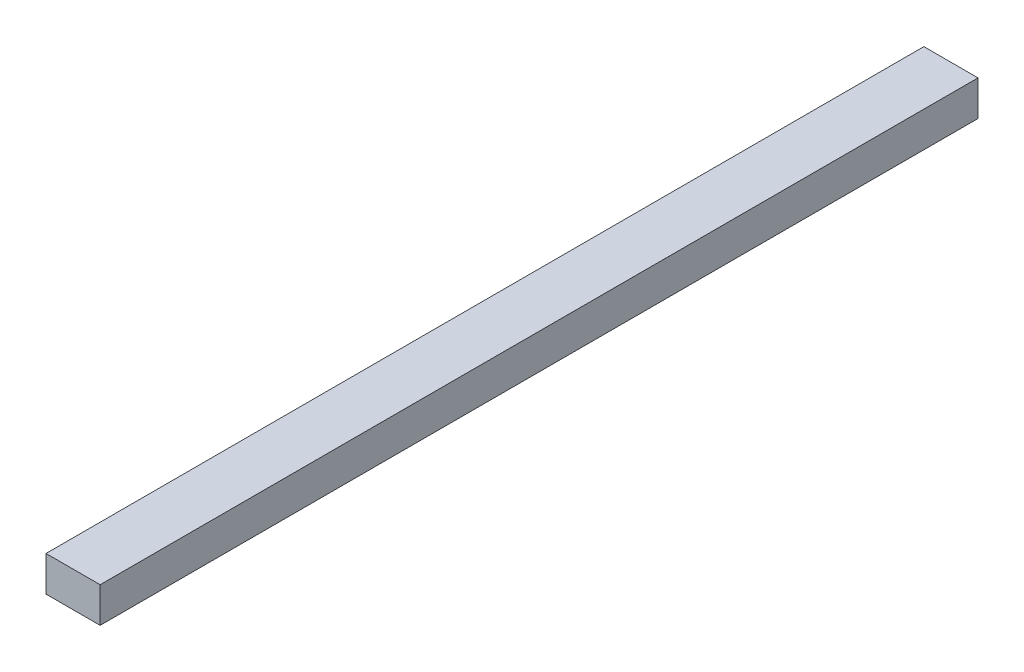
ISO-10303-21;
HEADER;
FILE_DESCRIPTION(('STEP AP214'),'2;1');
FILE_NAME('part.step','',(''),(''),'','','');
FILE_SCHEMA(('AUTOMOTIVE_DESIGN { 1 0 10303 214 1 1 1 1 }'));
ENDSEC;
DATA;
#1=APPLICATION_CONTEXT('core data for automotive mechanical design processes');
#2=APPLICATION_PROTOCOL_DEFINITION('international standard','automotive_design',2000,#1);
#3=PRODUCT_CONTEXT('',#1,'mechanical');
#4=PRODUCT('Part','Part','',(#3));
#5=PRODUCT_RELATED_PRODUCT_CATEGORY('part','',(#4));
#6=PRODUCT_DEFINITION_FORMATION('','',#4);
#7=PRODUCT_DEFINITION_CONTEXT('part definition',#1,'design');
#8=PRODUCT_DEFINITION('design','',#6,#7);
#9=PRODUCT_DEFINITION_SHAPE('','',#8);
#10=(LENGTH_UNIT() NAMED_UNIT(*) SI_UNIT(.MILLI.,.METRE.));
#11=(NAMED_UNIT(*) PLANE_ANGLE_UNIT() SI_UNIT($,.RADIAN.));
#12=(NAMED_UNIT(*) SI_UNIT($,.STERADIAN.) SOLID_ANGLE_UNIT());
#13=UNCERTAINTY_MEASURE_WITH_UNIT(LENGTH_MEASURE(1.E-05),#10,'distance_accuracy_value','');
#14=(GEOMETRIC_REPRESENTATION_CONTEXT(3) GLOBAL_UNCERTAINTY_ASSIGNED_CONTEXT((#13)) GLOBAL_UNIT_ASSIGNED_CONTEXT((#10,
#11,#12)) REPRESENTATION_CONTEXT('',''));
#15=CARTESIAN_POINT('',(0.,0.,0.));
#16=DIRECTION('',(0.,0.,1.));
#17=DIRECTION('',(1.,0.,0.));
#18=AXIS2_PLACEMENT_3D('',#15,#16,#17);
#19=CARTESIAN_POINT('',(0.,0.,-584.2));
#20=DIRECTION('',(0.,0.,1.));
#21=DIRECTION('',(1.,0.,0.));
#22=AXIS2_PLACEMENT_3D('',#19,#20,#21);
#23=PLANE('',#22);
#24=DIRECTION('',(0.,-1.,0.));
#25=VECTOR('',#24,1.);
#26=CARTESIAN_POINT('',(18.161,0.,-584.2));
#27=LINE('',#26,#25);
#28=CARTESIAN_POINT('',(18.161,29.591,-584.2));
#29=VERTEX_POINT('',#28);
#30=CARTESIAN_POINT('',(18.161,5.96900000000002,-584.2));
#31=VERTEX_POINT('',#30);
#32=EDGE_CURVE('E103',#29,#31,#27,.T.);
#33=ORIENTED_EDGE('',*,*,#32,.F.);
#34=DIRECTION('',(1.,0.,0.));
#35=VECTOR('',#34,1.);
#36=CARTESIAN_POINT('',(0.,29.591,-584.2));
#37=LINE('',#36,#35);
#38=CARTESIAN_POINT('',(-18.161,29.591,-584.2));
#39=VERTEX_POINT('',#38);
#40=EDGE_CURVE('E89',#39,#29,#37,.T.);
#41=ORIENTED_EDGE('',*,*,#40,.F.);
#42=DIRECTION('',(0.,-1.,0.));
#43=VECTOR('',#42,1.);
#44=CARTESIAN_POINT('',(-18.161,0.,-584.2));
#45=LINE('',#44,#43);
#46=CARTESIAN_POINT('',(-18.161,5.96900000000002,-584.2));
#47=VERTEX_POINT('',#46);
#48=EDGE_CURVE('E102',#39,#47,#45,.T.);
#49=ORIENTED_EDGE('',*,*,#48,.T.);
#50=DIRECTION('',(1.,0.,0.));
#51=VECTOR('',#50,1.);
#52=CARTESIAN_POINT('',(0.,5.96900000000002,-584.2));
#53=LINE('',#52,#51);
#54=EDGE_CURVE('E104',#47,#31,#53,.T.);
#55=ORIENTED_EDGE('',*,*,#54,.T.);
#56=EDGE_LOOP('',(#33,#41,#49,#55));
#57=FACE_BOUND('',#56,.T.);
#58=ADVANCED_FACE('F43',(#57),#23,.T.);
#59=CARTESIAN_POINT('',(0.,5.96900000000002,0.));
#60=DIRECTION('',(0.,1.,0.));
#61=DIRECTION('',(0.,0.,1.));
#62=AXIS2_PLACEMENT_3D('',#59,#60,#61);
#63=PLANE('',#62);
#64=ORIENTED_EDGE('',*,*,#54,.F.);
#65=DIRECTION('',(0.,0.,1.));
#66=VECTOR('',#65,1.);
#67=CARTESIAN_POINT('',(-18.161,5.96900000000002,0.));
#68=LINE('',#67,#66);
#69=CARTESIAN_POINT('',(-18.161,5.96900000000002,-1173.17130026192));
#70=VERTEX_POINT('',#69);
#71=EDGE_CURVE('E96',#70,#47,#68,.T.);
#72=ORIENTED_EDGE('',*,*,#71,.F.);
#73=DIRECTION('',(-1.,0.,0.));
#74=VECTOR('',#73,1.);
#75=CARTESIAN_POINT('',(0.,5.96900000000002,-1173.17130026192));
#76=LINE('',#75,#74);
#77=CARTESIAN_POINT('',(18.161,5.96900000000002,-1173.17130026192));
#78=VERTEX_POINT('',#77);
#79=EDGE_CURVE('E60',#78,#70,#76,.T.);
#80=ORIENTED_EDGE('',*,*,#79,.F.);
#81=DIRECTION('',(0.,0.,1.));
#82=VECTOR('',#81,1.);
#83=CARTESIAN_POINT('',(18.161,5.96900000000002,0.));
#84=LINE('',#83,#82);
#85=EDGE_CURVE('E97',#78,#31,#84,.T.);
#86=ORIENTED_EDGE('',*,*,#85,.T.);
#87=EDGE_LOOP('',(#64,#72,#80,#86));
#88=FACE_BOUND('',#87,.T.);
#89=ADVANCED_FACE('F116',(#88),#63,.F.);
#90=CARTESIAN_POINT('',(0.,29.591,0.));
#91=DIRECTION('',(0.,1.,0.));
#92=DIRECTION('',(0.,0.,1.));
#93=AXIS2_PLACEMENT_3D('',#90,#91,#92);
#94=PLANE('',#93);
#95=DIRECTION('',(0.,0.,1.));
#96=VECTOR('',#95,1.);
#97=CARTESIAN_POINT('',(-18.161,29.591,0.));
#98=LINE('',#97,#96);
#99=CARTESIAN_POINT('',(-18.161,29.591,-1173.17130026192));
#100=VERTEX_POINT('',#99);
#101=EDGE_CURVE('E85',#100,#39,#98,.T.);
#102=ORIENTED_EDGE('',*,*,#101,.T.);
#103=ORIENTED_EDGE('',*,*,#40,.T.);
#104=DIRECTION('',(0.,0.,1.));
#105=VECTOR('',#104,1.);
#106=CARTESIAN_POINT('',(18.161,29.591,0.));
#107=LINE('',#106,#105);
#108=CARTESIAN_POINT('',(18.161,29.591,-1173.17130026192));
#109=VERTEX_POINT('',#108);
#110=EDGE_CURVE('E47',#109,#29,#107,.T.);
#111=ORIENTED_EDGE('',*,*,#110,.F.);
#112=DIRECTION('',(-1.,0.,0.));
#113=VECTOR('',#112,1.);
#114=CARTESIAN_POINT('',(0.,29.591,-1173.17130026192));
#115=LINE('',#114,#113);
#116=EDGE_CURVE('E92',#109,#100,#115,.T.);
#117=ORIENTED_EDGE('',*,*,#116,.T.);
#118=EDGE_LOOP('',(#102,#103,#111,#117));
#119=FACE_BOUND('',#118,.T.);
#120=ADVANCED_FACE('F87',(#119),#94,.T.);
#121=CARTESIAN_POINT('',(18.161,0.,0.));
#122=DIRECTION('',(1.,0.,0.));
#123=DIRECTION('',(0.,0.,-1.));
#124=AXIS2_PLACEMENT_3D('',#121,#122,#123);
#125=PLANE('',#124);
#126=ORIENTED_EDGE('',*,*,#110,.T.);
#127=ORIENTED_EDGE('',*,*,#32,.T.);
#128=ORIENTED_EDGE('',*,*,#85,.F.);
#129=DIRECTION('',(0.,1.,0.));
#130=VECTOR('',#129,1.);
#131=CARTESIAN_POINT('',(18.161,0.,-1173.17130026192));
#132=LINE('',#131,#130);
#133=EDGE_CURVE('E52',#78,#109,#132,.T.);
#134=ORIENTED_EDGE('',*,*,#133,.T.);
#135=EDGE_LOOP('',(#126,#127,#128,#134));
#136=FACE_BOUND('',#135,.T.);
#137=ADVANCED_FACE('F45',(#136),#125,.T.);
#138=CARTESIAN_POINT('',(-18.161,0.,0.));
#139=DIRECTION('',(1.,0.,0.));
#140=DIRECTION('',(0.,0.,-1.));
#141=AXIS2_PLACEMENT_3D('',#138,#139,#140);
#142=PLANE('',#141);
#143=ORIENTED_EDGE('',*,*,#48,.F.);
#144=ORIENTED_EDGE('',*,*,#101,.F.);
#145=DIRECTION('',(0.,1.,0.));
#146=VECTOR('',#145,1.);
#147=CARTESIAN_POINT('',(-18.161,0.,-1173.17130026192));
#148=LINE('',#147,#146);
#149=EDGE_CURVE('E11',#70,#100,#148,.T.);
#150=ORIENTED_EDGE('',*,*,#149,.F.);
#151=ORIENTED_EDGE('',*,*,#71,.T.);
#152=EDGE_LOOP('',(#143,#144,#150,#151));
#153=FACE_BOUND('',#152,.T.);
#154=ADVANCED_FACE('F106',(#153),#142,.F.);
#155=CARTESIAN_POINT('',(0.,0.,-1173.17130026192));
#156=DIRECTION('',(0.,0.,1.));
#157=DIRECTION('',(1.,0.,0.));
#158=AXIS2_PLACEMENT_3D('',#155,#156,#157);
#159=PLANE('',#158);
#160=ORIENTED_EDGE('',*,*,#116,.F.);
#161=ORIENTED_EDGE('',*,*,#133,.F.);
#162=ORIENTED_EDGE('',*,*,#79,.T.);
#163=ORIENTED_EDGE('',*,*,#149,.T.);
#164=EDGE_LOOP('',(#160,#161,#162,#163));
#165=FACE_BOUND('',#164,.T.);
#166=ADVANCED_FACE('F126',(#165),#159,.F.);
#167=CLOSED_SHELL('',(#58,#89,#120,#137,#154,#166));
#168=MANIFOLD_SOLID_BREP('B2',#167);
#169=ADVANCED_BREP_SHAPE_REPRESENTATION('',(#18,#168),#14);
#170=SHAPE_DEFINITION_REPRESENTATION(#9,#169);
ENDSEC;
END-ISO-10303-21;
